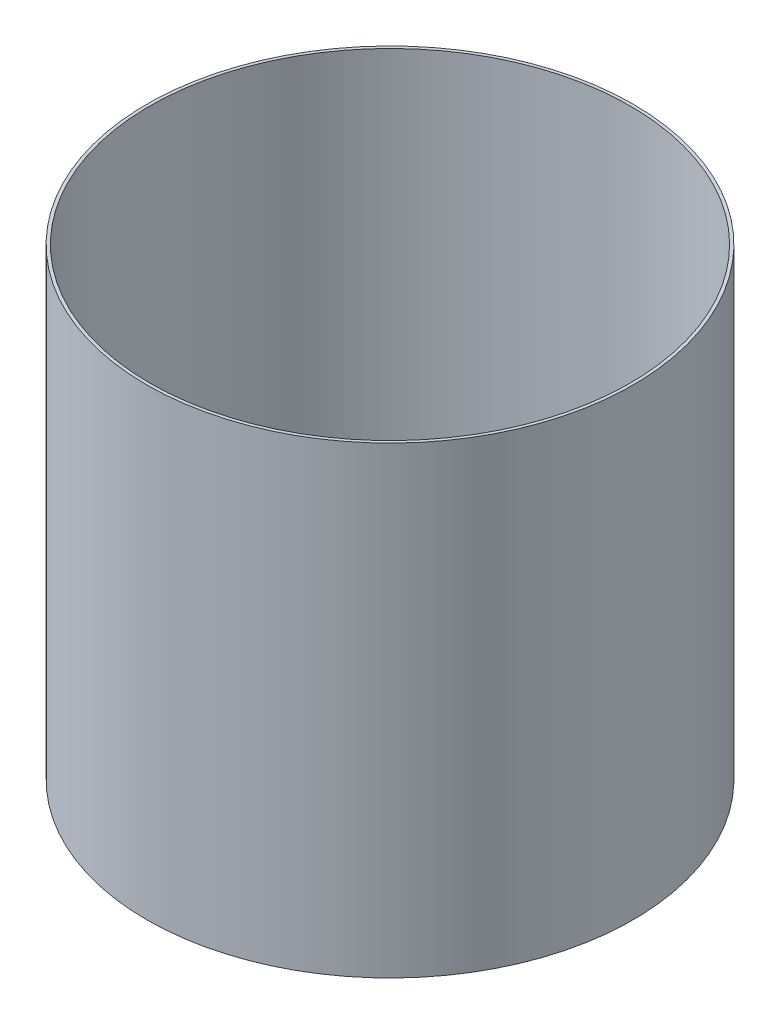
ISO-10303-21;
HEADER;
FILE_DESCRIPTION(('STEP AP214'),'2;1');
FILE_NAME('part.step','',(''),(''),'','','');
FILE_SCHEMA(('AUTOMOTIVE_DESIGN { 1 0 10303 214 1 1 1 1 }'));
ENDSEC;
DATA;
#1=APPLICATION_CONTEXT('core data for automotive mechanical design processes');
#2=APPLICATION_PROTOCOL_DEFINITION('international standard','automotive_design',2000,#1);
#3=PRODUCT_CONTEXT('',#1,'mechanical');
#4=PRODUCT('Part','Part','',(#3));
#5=PRODUCT_RELATED_PRODUCT_CATEGORY('part','',(#4));
#6=PRODUCT_DEFINITION_FORMATION('','',#4);
#7=PRODUCT_DEFINITION_CONTEXT('part definition',#1,'design');
#8=PRODUCT_DEFINITION('design','',#6,#7);
#9=PRODUCT_DEFINITION_SHAPE('','',#8);
#10=(LENGTH_UNIT() NAMED_UNIT(*) SI_UNIT(.MILLI.,.METRE.));
#11=(NAMED_UNIT(*) PLANE_ANGLE_UNIT() SI_UNIT($,.RADIAN.));
#12=(NAMED_UNIT(*) SI_UNIT($,.STERADIAN.) SOLID_ANGLE_UNIT());
#13=UNCERTAINTY_MEASURE_WITH_UNIT(LENGTH_MEASURE(1.E-05),#10,'distance_accuracy_value','');
#14=(GEOMETRIC_REPRESENTATION_CONTEXT(3) GLOBAL_UNCERTAINTY_ASSIGNED_CONTEXT((#13)) GLOBAL_UNIT_ASSIGNED_CONTEXT((#10,
#11,#12)) REPRESENTATION_CONTEXT('',''));
#15=CARTESIAN_POINT('',(0.,0.,0.));
#16=DIRECTION('',(0.,0.,1.));
#17=DIRECTION('',(1.,0.,0.));
#18=AXIS2_PLACEMENT_3D('',#15,#16,#17);
#19=CARTESIAN_POINT('',(0.,76.2,0.));
#20=DIRECTION('',(0.,1.,0.));
#21=DIRECTION('',(0.,0.,1.));
#22=AXIS2_PLACEMENT_3D('',#19,#20,#21);
#23=PLANE('',#22);
#24=CARTESIAN_POINT('',(0.,76.2,0.));
#25=DIRECTION('',(0.,1.,0.));
#26=DIRECTION('',(0.,0.,1.));
#27=AXIS2_PLACEMENT_3D('',#24,#25,#26);
#28=CIRCLE('',#27,40.);
#29=CARTESIAN_POINT('',(0.,76.2,40.));
#30=VERTEX_POINT('',#29);
#31=EDGE_CURVE('E10',#30,#30,#28,.T.);
#32=ORIENTED_EDGE('',*,*,#31,.T.);
#33=EDGE_LOOP('',(#32));
#34=FACE_BOUND('',#33,.T.);
#35=CARTESIAN_POINT('',(0.,76.2,0.));
#36=DIRECTION('',(0.,1.,0.));
#37=DIRECTION('',(0.,0.,1.));
#38=AXIS2_PLACEMENT_3D('',#35,#36,#37);
#39=CIRCLE('',#38,39.5);
#40=CARTESIAN_POINT('',(0.,76.2,39.5));
#41=VERTEX_POINT('',#40);
#42=EDGE_CURVE('E47',#41,#41,#39,.T.);
#43=ORIENTED_EDGE('',*,*,#42,.F.);
#44=EDGE_LOOP('',(#43));
#45=FACE_BOUND('',#44,.T.);
#46=ADVANCED_FACE('F36',(#34,#45),#23,.T.);
#47=CARTESIAN_POINT('',(0.,0.,0.));
#48=DIRECTION('',(0.,1.,0.));
#49=DIRECTION('',(0.,0.,1.));
#50=AXIS2_PLACEMENT_3D('',#47,#48,#49);
#51=PLANE('',#50);
#52=CARTESIAN_POINT('',(0.,0.,0.));
#53=DIRECTION('',(0.,1.,0.));
#54=DIRECTION('',(0.,0.,1.));
#55=AXIS2_PLACEMENT_3D('',#52,#53,#54);
#56=CIRCLE('',#55,40.);
#57=CARTESIAN_POINT('',(0.,0.,40.));
#58=VERTEX_POINT('',#57);
#59=EDGE_CURVE('E40',#58,#58,#56,.T.);
#60=ORIENTED_EDGE('',*,*,#59,.F.);
#61=EDGE_LOOP('',(#60));
#62=FACE_BOUND('',#61,.T.);
#63=CARTESIAN_POINT('',(0.,0.,0.));
#64=DIRECTION('',(0.,1.,0.));
#65=DIRECTION('',(0.,0.,1.));
#66=AXIS2_PLACEMENT_3D('',#63,#64,#65);
#67=CIRCLE('',#66,39.5);
#68=CARTESIAN_POINT('',(0.,0.,39.5));
#69=VERTEX_POINT('',#68);
#70=EDGE_CURVE('E49',#69,#69,#67,.T.);
#71=ORIENTED_EDGE('',*,*,#70,.T.);
#72=EDGE_LOOP('',(#71));
#73=FACE_BOUND('',#72,.T.);
#74=ADVANCED_FACE('F59',(#62,#73),#51,.F.);
#75=CARTESIAN_POINT('',(0.,76.2,0.));
#76=DIRECTION('',(0.,-1.,0.));
#77=DIRECTION('',(0.,0.,-1.));
#78=AXIS2_PLACEMENT_3D('',#75,#76,#77);
#79=CYLINDRICAL_SURFACE('',#78,40.);
#80=ORIENTED_EDGE('',*,*,#31,.F.);
#81=EDGE_LOOP('',(#80));
#82=FACE_BOUND('',#81,.T.);
#83=ORIENTED_EDGE('',*,*,#59,.T.);
#84=EDGE_LOOP('',(#83));
#85=FACE_BOUND('',#84,.T.);
#86=ADVANCED_FACE('F38',(#82,#85),#79,.T.);
#87=CARTESIAN_POINT('',(0.,76.2,0.));
#88=DIRECTION('',(0.,-1.,0.));
#89=DIRECTION('',(0.,0.,-1.));
#90=AXIS2_PLACEMENT_3D('',#87,#88,#89);
#91=CYLINDRICAL_SURFACE('',#90,39.5);
#92=ORIENTED_EDGE('',*,*,#42,.T.);
#93=EDGE_LOOP('',(#92));
#94=FACE_BOUND('',#93,.T.);
#95=ORIENTED_EDGE('',*,*,#70,.F.);
#96=EDGE_LOOP('',(#95));
#97=FACE_BOUND('',#96,.T.);
#98=ADVANCED_FACE('F55',(#94,#97),#91,.F.);
#99=CLOSED_SHELL('',(#46,#74,#86,#98));
#100=MANIFOLD_SOLID_BREP('B2',#99);
#101=ADVANCED_BREP_SHAPE_REPRESENTATION('',(#18,#100),#14);
#102=SHAPE_DEFINITION_REPRESENTATION(#9,#101);
ENDSEC;
END-ISO-10303-21;
